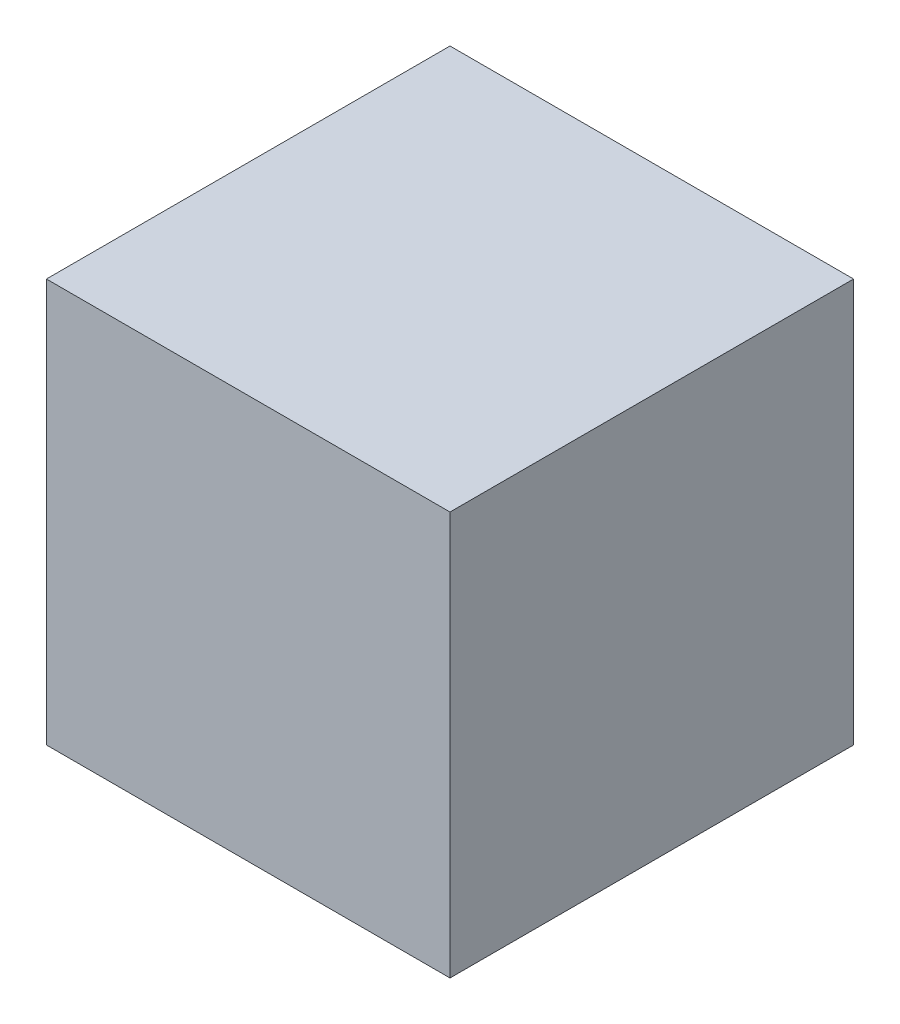
ISO-10303-21;
HEADER;
FILE_DESCRIPTION(('STEP AP214'),'2;1');
FILE_NAME('part.step','',(''),(''),'','','');
FILE_SCHEMA(('AUTOMOTIVE_DESIGN { 1 0 10303 214 1 1 1 1 }'));
ENDSEC;
DATA;
#1=APPLICATION_CONTEXT('core data for automotive mechanical design processes');
#2=APPLICATION_PROTOCOL_DEFINITION('international standard','automotive_design',2000,#1);
#3=PRODUCT_CONTEXT('',#1,'mechanical');
#4=PRODUCT('Part','Part','',(#3));
#5=PRODUCT_RELATED_PRODUCT_CATEGORY('part','',(#4));
#6=PRODUCT_DEFINITION_FORMATION('','',#4);
#7=PRODUCT_DEFINITION_CONTEXT('part definition',#1,'design');
#8=PRODUCT_DEFINITION('design','',#6,#7);
#9=PRODUCT_DEFINITION_SHAPE('','',#8);
#10=(LENGTH_UNIT() NAMED_UNIT(*) SI_UNIT(.MILLI.,.METRE.));
#11=(NAMED_UNIT(*) PLANE_ANGLE_UNIT() SI_UNIT($,.RADIAN.));
#12=(NAMED_UNIT(*) SI_UNIT($,.STERADIAN.) SOLID_ANGLE_UNIT());
#13=UNCERTAINTY_MEASURE_WITH_UNIT(LENGTH_MEASURE(1.E-05),#10,'distance_accuracy_value','');
#14=(GEOMETRIC_REPRESENTATION_CONTEXT(3) GLOBAL_UNCERTAINTY_ASSIGNED_CONTEXT((#13)) GLOBAL_UNIT_ASSIGNED_CONTEXT((#10,
#11,#12)) REPRESENTATION_CONTEXT('',''));
#15=CARTESIAN_POINT('',(0.,0.,0.));
#16=DIRECTION('',(0.,0.,1.));
#17=DIRECTION('',(1.,0.,0.));
#18=AXIS2_PLACEMENT_3D('',#15,#16,#17);
#19=CARTESIAN_POINT('',(0.30000194,0.2999994,0.));
#20=DIRECTION('',(0.,-1.,0.));
#21=DIRECTION('',(0.,0.,-1.));
#22=AXIS2_PLACEMENT_3D('',#19,#20,#21);
#23=PLANE('',#22);
#24=DIRECTION('',(0.,0.,-1.));
#25=VECTOR('',#24,1.);
#26=CARTESIAN_POINT('',(-0.2999994,0.2999994,0.));
#27=LINE('',#26,#25);
#28=CARTESIAN_POINT('',(-0.2999994,0.2999994,0.));
#29=VERTEX_POINT('',#28);
#30=CARTESIAN_POINT('',(-0.2999994,0.2999994,0.5999988));
#31=VERTEX_POINT('',#30);
#32=EDGE_CURVE('E20',#29,#31,#27,.F.);
#33=ORIENTED_EDGE('',*,*,#32,.T.);
#34=DIRECTION('',(-1.,0.,0.));
#35=VECTOR('',#34,1.);
#36=CARTESIAN_POINT('',(-0.2999994,0.2999994,0.5999988));
#37=LINE('',#36,#35);
#38=CARTESIAN_POINT('',(0.30000194,0.2999994,0.5999988));
#39=VERTEX_POINT('',#38);
#40=EDGE_CURVE('E55',#31,#39,#37,.F.);
#41=ORIENTED_EDGE('',*,*,#40,.T.);
#42=DIRECTION('',(0.,0.,1.));
#43=VECTOR('',#42,1.);
#44=CARTESIAN_POINT('',(0.30000194,0.2999994,0.));
#45=LINE('',#44,#43);
#46=CARTESIAN_POINT('',(0.30000194,0.2999994,0.));
#47=VERTEX_POINT('',#46);
#48=EDGE_CURVE('E74',#39,#47,#45,.F.);
#49=ORIENTED_EDGE('',*,*,#48,.T.);
#50=DIRECTION('',(-1.,0.,0.));
#51=VECTOR('',#50,1.);
#52=CARTESIAN_POINT('',(-0.2999994,0.2999994,0.));
#53=LINE('',#52,#51);
#54=EDGE_CURVE('E66',#29,#47,#53,.F.);
#55=ORIENTED_EDGE('',*,*,#54,.F.);
#56=EDGE_LOOP('',(#33,#41,#49,#55));
#57=FACE_BOUND('',#56,.T.);
#58=ADVANCED_FACE('F17',(#57),#23,.F.);
#59=CARTESIAN_POINT('',(-0.2999994,0.2999994,0.));
#60=DIRECTION('',(1.,0.,0.));
#61=DIRECTION('',(0.,0.,-1.));
#62=AXIS2_PLACEMENT_3D('',#59,#60,#61);
#63=PLANE('',#62);
#64=DIRECTION('',(0.,0.,1.));
#65=VECTOR('',#64,1.);
#66=CARTESIAN_POINT('',(-0.2999994,-0.2999994,0.));
#67=LINE('',#66,#65);
#68=CARTESIAN_POINT('',(-0.2999994,-0.2999994,0.));
#69=VERTEX_POINT('',#68);
#70=CARTESIAN_POINT('',(-0.2999994,-0.2999994,0.5999988));
#71=VERTEX_POINT('',#70);
#72=EDGE_CURVE('E72',#69,#71,#67,.T.);
#73=ORIENTED_EDGE('',*,*,#72,.T.);
#74=DIRECTION('',(0.,1.,0.));
#75=VECTOR('',#74,1.);
#76=CARTESIAN_POINT('',(-0.2999994,0.2999994,0.5999988));
#77=LINE('',#76,#75);
#78=EDGE_CURVE('E62',#71,#31,#77,.T.);
#79=ORIENTED_EDGE('',*,*,#78,.T.);
#80=ORIENTED_EDGE('',*,*,#32,.F.);
#81=DIRECTION('',(0.,1.,0.));
#82=VECTOR('',#81,1.);
#83=CARTESIAN_POINT('',(-0.2999994,0.2999994,0.));
#84=LINE('',#83,#82);
#85=EDGE_CURVE('E80',#69,#29,#84,.T.);
#86=ORIENTED_EDGE('',*,*,#85,.F.);
#87=EDGE_LOOP('',(#73,#79,#80,#86));
#88=FACE_BOUND('',#87,.T.);
#89=ADVANCED_FACE('F71',(#88),#63,.F.);
#90=CARTESIAN_POINT('',(-0.2999994,0.2999994,0.5999988));
#91=DIRECTION('',(0.,0.,-1.));
#92=DIRECTION('',(-1.,0.,0.));
#93=AXIS2_PLACEMENT_3D('',#90,#91,#92);
#94=PLANE('',#93);
#95=DIRECTION('',(1.,0.,0.));
#96=VECTOR('',#95,1.);
#97=CARTESIAN_POINT('',(-0.2999994,-0.2999994,0.5999988));
#98=LINE('',#97,#96);
#99=CARTESIAN_POINT('',(0.30000194,-0.2999994,0.5999988));
#100=VERTEX_POINT('',#99);
#101=EDGE_CURVE('E83',#71,#100,#98,.T.);
#102=ORIENTED_EDGE('',*,*,#101,.T.);
#103=DIRECTION('',(0.,1.,0.));
#104=VECTOR('',#103,1.);
#105=CARTESIAN_POINT('',(0.30000194,-0.2999994,0.5999988));
#106=LINE('',#105,#104);
#107=EDGE_CURVE('E64',#100,#39,#106,.T.);
#108=ORIENTED_EDGE('',*,*,#107,.T.);
#109=ORIENTED_EDGE('',*,*,#40,.F.);
#110=ORIENTED_EDGE('',*,*,#78,.F.);
#111=EDGE_LOOP('',(#102,#108,#109,#110));
#112=FACE_BOUND('',#111,.T.);
#113=ADVANCED_FACE('F60',(#112),#94,.F.);
#114=CARTESIAN_POINT('',(0.30000194,-0.2999994,0.));
#115=DIRECTION('',(-1.,0.,0.));
#116=DIRECTION('',(0.,0.,1.));
#117=AXIS2_PLACEMENT_3D('',#114,#115,#116);
#118=PLANE('',#117);
#119=ORIENTED_EDGE('',*,*,#48,.F.);
#120=ORIENTED_EDGE('',*,*,#107,.F.);
#121=DIRECTION('',(0.,0.,1.));
#122=VECTOR('',#121,1.);
#123=CARTESIAN_POINT('',(0.30000194,-0.2999994,0.));
#124=LINE('',#123,#122);
#125=CARTESIAN_POINT('',(0.30000194,-0.2999994,0.));
#126=VERTEX_POINT('',#125);
#127=EDGE_CURVE('E26',#100,#126,#124,.F.);
#128=ORIENTED_EDGE('',*,*,#127,.T.);
#129=DIRECTION('',(0.,1.,0.));
#130=VECTOR('',#129,1.);
#131=CARTESIAN_POINT('',(0.30000194,0.2999994,0.));
#132=LINE('',#131,#130);
#133=EDGE_CURVE('E34',#47,#126,#132,.F.);
#134=ORIENTED_EDGE('',*,*,#133,.F.);
#135=EDGE_LOOP('',(#119,#120,#128,#134));
#136=FACE_BOUND('',#135,.T.);
#137=ADVANCED_FACE('F88',(#136),#118,.F.);
#138=CARTESIAN_POINT('',(-0.2999994,0.2999994,0.));
#139=DIRECTION('',(0.,0.,-1.));
#140=DIRECTION('',(-1.,0.,0.));
#141=AXIS2_PLACEMENT_3D('',#138,#139,#140);
#142=PLANE('',#141);
#143=DIRECTION('',(1.,0.,0.));
#144=VECTOR('',#143,1.);
#145=CARTESIAN_POINT('',(-0.2999994,-0.2999994,0.));
#146=LINE('',#145,#144);
#147=EDGE_CURVE('E11',#126,#69,#146,.F.);
#148=ORIENTED_EDGE('',*,*,#147,.T.);
#149=ORIENTED_EDGE('',*,*,#85,.T.);
#150=ORIENTED_EDGE('',*,*,#54,.T.);
#151=ORIENTED_EDGE('',*,*,#133,.T.);
#152=EDGE_LOOP('',(#148,#149,#150,#151));
#153=FACE_BOUND('',#152,.T.);
#154=ADVANCED_FACE('F91',(#153),#142,.T.);
#155=CARTESIAN_POINT('',(-0.2999994,-0.2999994,0.));
#156=DIRECTION('',(0.,1.,0.));
#157=DIRECTION('',(0.,0.,1.));
#158=AXIS2_PLACEMENT_3D('',#155,#156,#157);
#159=PLANE('',#158);
#160=ORIENTED_EDGE('',*,*,#127,.F.);
#161=ORIENTED_EDGE('',*,*,#101,.F.);
#162=ORIENTED_EDGE('',*,*,#72,.F.);
#163=ORIENTED_EDGE('',*,*,#147,.F.);
#164=EDGE_LOOP('',(#160,#161,#162,#163));
#165=FACE_BOUND('',#164,.T.);
#166=ADVANCED_FACE('F90',(#165),#159,.F.);
#167=CLOSED_SHELL('',(#58,#89,#113,#137,#154,#166));
#168=MANIFOLD_SOLID_BREP('B1',#167);
#169=ADVANCED_BREP_SHAPE_REPRESENTATION('',(#18,#168),#14);
#170=SHAPE_DEFINITION_REPRESENTATION(#9,#169);
ENDSEC;
END-ISO-10303-21;
